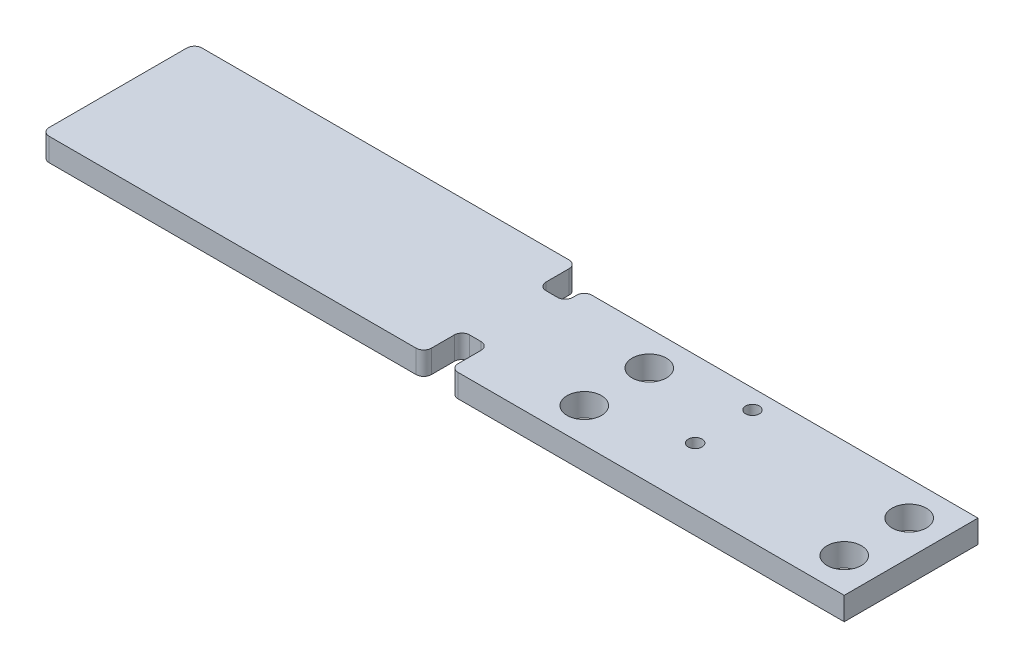
ISO-10303-21;
HEADER;
FILE_DESCRIPTION(('STEP AP214'),'2;1');
FILE_NAME('part.step','',(''),(''),'','','');
FILE_SCHEMA(('AUTOMOTIVE_DESIGN { 1 0 10303 214 1 1 1 1 }'));
ENDSEC;
DATA;
#1=APPLICATION_CONTEXT('core data for automotive mechanical design processes');
#2=APPLICATION_PROTOCOL_DEFINITION('international standard','automotive_design',2000,#1);
#3=PRODUCT_CONTEXT('',#1,'mechanical');
#4=PRODUCT('Part','Part','',(#3));
#5=PRODUCT_RELATED_PRODUCT_CATEGORY('part','',(#4));
#6=PRODUCT_DEFINITION_FORMATION('','',#4);
#7=PRODUCT_DEFINITION_CONTEXT('part definition',#1,'design');
#8=PRODUCT_DEFINITION('design','',#6,#7);
#9=PRODUCT_DEFINITION_SHAPE('','',#8);
#10=(LENGTH_UNIT() NAMED_UNIT(*) SI_UNIT(.MILLI.,.METRE.));
#11=(NAMED_UNIT(*) PLANE_ANGLE_UNIT() SI_UNIT($,.RADIAN.));
#12=(NAMED_UNIT(*) SI_UNIT($,.STERADIAN.) SOLID_ANGLE_UNIT());
#13=UNCERTAINTY_MEASURE_WITH_UNIT(LENGTH_MEASURE(1.E-05),#10,'distance_accuracy_value','');
#14=(GEOMETRIC_REPRESENTATION_CONTEXT(3) GLOBAL_UNCERTAINTY_ASSIGNED_CONTEXT((#13)) GLOBAL_UNIT_ASSIGNED_CONTEXT((#10,
#11,#12)) REPRESENTATION_CONTEXT('',''));
#15=CARTESIAN_POINT('',(0.,0.,0.));
#16=DIRECTION('',(0.,0.,1.));
#17=DIRECTION('',(1.,0.,0.));
#18=AXIS2_PLACEMENT_3D('',#15,#16,#17);
#19=CARTESIAN_POINT('',(0.,6.,-22.1596649405381));
#20=DIRECTION('',(0.,0.,-1.));
#21=DIRECTION('',(-1.,0.,0.));
#22=AXIS2_PLACEMENT_3D('',#19,#20,#21);
#23=PLANE('',#22);
#24=DIRECTION('',(1.,0.,0.));
#25=VECTOR('',#24,1.);
#26=CARTESIAN_POINT('',(0.,0.,-22.1596649405381));
#27=LINE('',#26,#25);
#28=CARTESIAN_POINT('',(28.4494296482818,0.,-22.1596649405381));
#29=VERTEX_POINT('',#28);
#30=CARTESIAN_POINT('',(31.4610570202952,0.,-22.1596649405381));
#31=VERTEX_POINT('',#30);
#32=EDGE_CURVE('E256',#29,#31,#27,.T.);
#33=ORIENTED_EDGE('',*,*,#32,.T.);
#34=DIRECTION('',(0.,-1.,0.));
#35=VECTOR('',#34,1.);
#36=CARTESIAN_POINT('',(31.4610570202952,6.,-22.1596649405381));
#37=LINE('',#36,#35);
#38=CARTESIAN_POINT('',(31.4610570202952,6.,-22.1596649405381));
#39=VERTEX_POINT('',#38);
#40=EDGE_CURVE('E11',#39,#31,#37,.T.);
#41=ORIENTED_EDGE('',*,*,#40,.F.);
#42=DIRECTION('',(1.,0.,0.));
#43=VECTOR('',#42,1.);
#44=CARTESIAN_POINT('',(0.,6.,-22.1596649405381));
#45=LINE('',#44,#43);
#46=CARTESIAN_POINT('',(28.4494296482818,6.,-22.1596649405381));
#47=VERTEX_POINT('',#46);
#48=EDGE_CURVE('E889',#47,#39,#45,.T.);
#49=ORIENTED_EDGE('',*,*,#48,.F.);
#50=DIRECTION('',(0.,-1.,0.));
#51=VECTOR('',#50,1.);
#52=CARTESIAN_POINT('',(28.4494296482818,6.,-22.1596649405381));
#53=LINE('',#52,#51);
#54=EDGE_CURVE('E63',#47,#29,#53,.T.);
#55=ORIENTED_EDGE('',*,*,#54,.T.);
#56=EDGE_LOOP('',(#33,#41,#49,#55));
#57=FACE_BOUND('',#56,.T.);
#58=ADVANCED_FACE('F45',(#57),#23,.F.);
#59=CARTESIAN_POINT('',(31.4610570202952,6.,-20.1596649405381));
#60=DIRECTION('',(0.,-1.,0.));
#61=DIRECTION('',(0.,0.,-1.));
#62=AXIS2_PLACEMENT_3D('',#59,#60,#61);
#63=CYLINDRICAL_SURFACE('',#62,2.);
#64=CARTESIAN_POINT('',(31.4610570202952,0.,-20.1596649405381));
#65=DIRECTION('',(0.,1.,0.));
#66=DIRECTION('',(0.,0.,1.));
#67=AXIS2_PLACEMENT_3D('',#64,#65,#66);
#68=CIRCLE('',#67,2.);
#69=CARTESIAN_POINT('',(33.4610570202952,0.,-20.1596649405381));
#70=VERTEX_POINT('',#69);
#71=EDGE_CURVE('E259',#31,#70,#68,.F.);
#72=ORIENTED_EDGE('',*,*,#71,.T.);
#73=DIRECTION('',(0.,-1.,0.));
#74=VECTOR('',#73,1.);
#75=CARTESIAN_POINT('',(33.4610570202952,6.,-20.1596649405381));
#76=LINE('',#75,#74);
#77=CARTESIAN_POINT('',(33.4610570202952,6.,-20.1596649405381));
#78=VERTEX_POINT('',#77);
#79=EDGE_CURVE('E55',#78,#70,#76,.T.);
#80=ORIENTED_EDGE('',*,*,#79,.F.);
#81=CARTESIAN_POINT('',(31.4610570202952,6.,-20.1596649405381));
#82=DIRECTION('',(0.,1.,0.));
#83=DIRECTION('',(0.,0.,1.));
#84=AXIS2_PLACEMENT_3D('',#81,#82,#83);
#85=CIRCLE('',#84,2.);
#86=EDGE_CURVE('E143',#39,#78,#85,.F.);
#87=ORIENTED_EDGE('',*,*,#86,.F.);
#88=ORIENTED_EDGE('',*,*,#40,.T.);
#89=EDGE_LOOP('',(#72,#80,#87,#88));
#90=FACE_BOUND('',#89,.T.);
#91=ADVANCED_FACE('F491',(#90),#63,.F.);
#92=CARTESIAN_POINT('',(33.4610570202952,6.,0.));
#93=DIRECTION('',(1.,0.,0.));
#94=DIRECTION('',(0.,0.,-1.));
#95=AXIS2_PLACEMENT_3D('',#92,#93,#94);
#96=PLANE('',#95);
#97=DIRECTION('',(0.,0.,1.));
#98=VECTOR('',#97,1.);
#99=CARTESIAN_POINT('',(33.4610570202952,0.,0.));
#100=LINE('',#99,#98);
#101=CARTESIAN_POINT('',(33.4610570202952,0.,-14.1596649405381));
#102=VERTEX_POINT('',#101);
#103=EDGE_CURVE('E262',#70,#102,#100,.T.);
#104=ORIENTED_EDGE('',*,*,#103,.T.);
#105=DIRECTION('',(0.,-1.,0.));
#106=VECTOR('',#105,1.);
#107=CARTESIAN_POINT('',(33.4610570202952,6.,-14.1596649405381));
#108=LINE('',#107,#106);
#109=CARTESIAN_POINT('',(33.4610570202952,6.,-14.1596649405381));
#110=VERTEX_POINT('',#109);
#111=EDGE_CURVE('E389',#110,#102,#108,.T.);
#112=ORIENTED_EDGE('',*,*,#111,.F.);
#113=DIRECTION('',(0.,0.,1.));
#114=VECTOR('',#113,1.);
#115=CARTESIAN_POINT('',(33.4610570202952,6.,0.));
#116=LINE('',#115,#114);
#117=EDGE_CURVE('E399',#78,#110,#116,.T.);
#118=ORIENTED_EDGE('',*,*,#117,.F.);
#119=ORIENTED_EDGE('',*,*,#79,.T.);
#120=EDGE_LOOP('',(#104,#112,#118,#119));
#121=FACE_BOUND('',#120,.T.);
#122=ADVANCED_FACE('F397',(#121),#96,.F.);
#123=CARTESIAN_POINT('',(35.4610570202952,6.,-14.1596649405381));
#124=DIRECTION('',(0.,-1.,0.));
#125=DIRECTION('',(0.,0.,-1.));
#126=AXIS2_PLACEMENT_3D('',#123,#124,#125);
#127=CYLINDRICAL_SURFACE('',#126,2.);
#128=CARTESIAN_POINT('',(35.4610570202952,0.,-14.1596649405381));
#129=DIRECTION('',(0.,1.,0.));
#130=DIRECTION('',(0.,0.,1.));
#131=AXIS2_PLACEMENT_3D('',#128,#129,#130);
#132=CIRCLE('',#131,2.);
#133=CARTESIAN_POINT('',(35.4610570202952,0.,-12.1596649405381));
#134=VERTEX_POINT('',#133);
#135=EDGE_CURVE('E265',#102,#134,#132,.T.);
#136=ORIENTED_EDGE('',*,*,#135,.T.);
#137=DIRECTION('',(0.,-1.,0.));
#138=VECTOR('',#137,1.);
#139=CARTESIAN_POINT('',(35.4610570202952,6.,-12.1596649405381));
#140=LINE('',#139,#138);
#141=CARTESIAN_POINT('',(35.4610570202952,6.,-12.1596649405381));
#142=VERTEX_POINT('',#141);
#143=EDGE_CURVE('E385',#142,#134,#140,.T.);
#144=ORIENTED_EDGE('',*,*,#143,.F.);
#145=CARTESIAN_POINT('',(35.4610570202952,6.,-14.1596649405381));
#146=DIRECTION('',(0.,1.,0.));
#147=DIRECTION('',(0.,0.,1.));
#148=AXIS2_PLACEMENT_3D('',#145,#146,#147);
#149=CIRCLE('',#148,2.);
#150=EDGE_CURVE('E417',#110,#142,#149,.T.);
#151=ORIENTED_EDGE('',*,*,#150,.F.);
#152=ORIENTED_EDGE('',*,*,#111,.T.);
#153=EDGE_LOOP('',(#136,#144,#151,#152));
#154=FACE_BOUND('',#153,.T.);
#155=ADVANCED_FACE('F407',(#154),#127,.T.);
#156=CARTESIAN_POINT('',(0.,6.,-12.1596649405381));
#157=DIRECTION('',(0.,0.,-1.));
#158=DIRECTION('',(-1.,0.,0.));
#159=AXIS2_PLACEMENT_3D('',#156,#157,#158);
#160=PLANE('',#159);
#161=DIRECTION('',(1.,0.,0.));
#162=VECTOR('',#161,1.);
#163=CARTESIAN_POINT('',(0.,0.,-12.1596649405381));
#164=LINE('',#163,#162);
#165=CARTESIAN_POINT('',(136.461057020295,0.,-12.1596649405381));
#166=VERTEX_POINT('',#165);
#167=EDGE_CURVE('E268',#134,#166,#164,.T.);
#168=ORIENTED_EDGE('',*,*,#167,.T.);
#169=DIRECTION('',(0.,-1.,0.));
#170=VECTOR('',#169,1.);
#171=CARTESIAN_POINT('',(136.461057020295,6.,-12.1596649405381));
#172=LINE('',#171,#170);
#173=CARTESIAN_POINT('',(136.461057020295,6.,-12.1596649405381));
#174=VERTEX_POINT('',#173);
#175=EDGE_CURVE('E381',#174,#166,#172,.T.);
#176=ORIENTED_EDGE('',*,*,#175,.F.);
#177=DIRECTION('',(1.,0.,0.));
#178=VECTOR('',#177,1.);
#179=CARTESIAN_POINT('',(0.,6.,-12.1596649405381));
#180=LINE('',#179,#178);
#181=EDGE_CURVE('E413',#142,#174,#180,.T.);
#182=ORIENTED_EDGE('',*,*,#181,.F.);
#183=ORIENTED_EDGE('',*,*,#143,.T.);
#184=EDGE_LOOP('',(#168,#176,#182,#183));
#185=FACE_BOUND('',#184,.T.);
#186=ADVANCED_FACE('F411',(#185),#160,.F.);
#187=CARTESIAN_POINT('',(136.461057020295,6.,0.));
#188=DIRECTION('',(-1.,0.,0.));
#189=DIRECTION('',(0.,0.,1.));
#190=AXIS2_PLACEMENT_3D('',#187,#188,#189);
#191=PLANE('',#190);
#192=DIRECTION('',(0.,0.,-1.));
#193=VECTOR('',#192,1.);
#194=CARTESIAN_POINT('',(136.461057020295,0.,0.));
#195=LINE('',#194,#193);
#196=CARTESIAN_POINT('',(136.461057020295,0.,-47.1596649405381));
#197=VERTEX_POINT('',#196);
#198=EDGE_CURVE('E271',#166,#197,#195,.T.);
#199=ORIENTED_EDGE('',*,*,#198,.T.);
#200=DIRECTION('',(0.,-1.,0.));
#201=VECTOR('',#200,1.);
#202=CARTESIAN_POINT('',(136.461057020295,6.,-47.1596649405381));
#203=LINE('',#202,#201);
#204=CARTESIAN_POINT('',(136.461057020295,6.,-47.1596649405381));
#205=VERTEX_POINT('',#204);
#206=EDGE_CURVE('E377',#205,#197,#203,.T.);
#207=ORIENTED_EDGE('',*,*,#206,.F.);
#208=DIRECTION('',(0.,0.,-1.));
#209=VECTOR('',#208,1.);
#210=CARTESIAN_POINT('',(136.461057020295,6.,0.));
#211=LINE('',#210,#209);
#212=EDGE_CURVE('E416',#174,#205,#211,.T.);
#213=ORIENTED_EDGE('',*,*,#212,.F.);
#214=ORIENTED_EDGE('',*,*,#175,.T.);
#215=EDGE_LOOP('',(#199,#207,#213,#214));
#216=FACE_BOUND('',#215,.T.);
#217=ADVANCED_FACE('F747',(#216),#191,.F.);
#218=CARTESIAN_POINT('',(0.,6.,-47.1596649405381));
#219=DIRECTION('',(0.,0.,1.));
#220=DIRECTION('',(1.,0.,0.));
#221=AXIS2_PLACEMENT_3D('',#218,#219,#220);
#222=PLANE('',#221);
#223=DIRECTION('',(-1.,0.,0.));
#224=VECTOR('',#223,1.);
#225=CARTESIAN_POINT('',(0.,0.,-47.1596649405381));
#226=LINE('',#225,#224);
#227=CARTESIAN_POINT('',(35.4610570202952,0.,-47.1596649405381));
#228=VERTEX_POINT('',#227);
#229=EDGE_CURVE('E274',#197,#228,#226,.T.);
#230=ORIENTED_EDGE('',*,*,#229,.T.);
#231=DIRECTION('',(0.,-1.,0.));
#232=VECTOR('',#231,1.);
#233=CARTESIAN_POINT('',(35.4610570202952,6.,-47.1596649405381));
#234=LINE('',#233,#232);
#235=CARTESIAN_POINT('',(35.4610570202952,6.,-47.1596649405381));
#236=VERTEX_POINT('',#235);
#237=EDGE_CURVE('E373',#236,#228,#234,.T.);
#238=ORIENTED_EDGE('',*,*,#237,.F.);
#239=DIRECTION('',(-1.,0.,0.));
#240=VECTOR('',#239,1.);
#241=CARTESIAN_POINT('',(0.,6.,-47.1596649405381));
#242=LINE('',#241,#240);
#243=EDGE_CURVE('E421',#205,#236,#242,.T.);
#244=ORIENTED_EDGE('',*,*,#243,.F.);
#245=ORIENTED_EDGE('',*,*,#206,.T.);
#246=EDGE_LOOP('',(#230,#238,#244,#245));
#247=FACE_BOUND('',#246,.T.);
#248=ADVANCED_FACE('F736',(#247),#222,.F.);
#249=CARTESIAN_POINT('',(35.4610570202952,6.,-45.1596649405381));
#250=DIRECTION('',(0.,-1.,0.));
#251=DIRECTION('',(0.,0.,-1.));
#252=AXIS2_PLACEMENT_3D('',#249,#250,#251);
#253=CYLINDRICAL_SURFACE('',#252,2.);
#254=CARTESIAN_POINT('',(35.4610570202952,0.,-45.1596649405381));
#255=DIRECTION('',(0.,1.,0.));
#256=DIRECTION('',(0.,0.,1.));
#257=AXIS2_PLACEMENT_3D('',#254,#255,#256);
#258=CIRCLE('',#257,2.);
#259=CARTESIAN_POINT('',(33.4610570202952,0.,-45.1596649405381));
#260=VERTEX_POINT('',#259);
#261=EDGE_CURVE('E277',#228,#260,#258,.T.);
#262=ORIENTED_EDGE('',*,*,#261,.T.);
#263=DIRECTION('',(0.,-1.,0.));
#264=VECTOR('',#263,1.);
#265=CARTESIAN_POINT('',(33.4610570202952,6.,-45.1596649405381));
#266=LINE('',#265,#264);
#267=CARTESIAN_POINT('',(33.4610570202952,6.,-45.1596649405381));
#268=VERTEX_POINT('',#267);
#269=EDGE_CURVE('E370',#268,#260,#266,.T.);
#270=ORIENTED_EDGE('',*,*,#269,.F.);
#271=CARTESIAN_POINT('',(35.4610570202952,6.,-45.1596649405381));
#272=DIRECTION('',(0.,1.,0.));
#273=DIRECTION('',(0.,0.,1.));
#274=AXIS2_PLACEMENT_3D('',#271,#272,#273);
#275=CIRCLE('',#274,2.);
#276=EDGE_CURVE('E428',#236,#268,#275,.T.);
#277=ORIENTED_EDGE('',*,*,#276,.F.);
#278=ORIENTED_EDGE('',*,*,#237,.T.);
#279=EDGE_LOOP('',(#262,#270,#277,#278));
#280=FACE_BOUND('',#279,.T.);
#281=ADVANCED_FACE('F725',(#280),#253,.T.);
#282=CARTESIAN_POINT('',(33.4610570202952,6.,0.));
#283=DIRECTION('',(-1.,0.,0.));
#284=DIRECTION('',(0.,0.,1.));
#285=AXIS2_PLACEMENT_3D('',#282,#283,#284);
#286=PLANE('',#285);
#287=DIRECTION('',(0.,0.,-1.));
#288=VECTOR('',#287,1.);
#289=CARTESIAN_POINT('',(33.4610570202952,0.,0.));
#290=LINE('',#289,#288);
#291=CARTESIAN_POINT('',(33.4610570202952,0.,-44.1596649405381));
#292=VERTEX_POINT('',#291);
#293=EDGE_CURVE('E281',#292,#260,#290,.T.);
#294=ORIENTED_EDGE('',*,*,#293,.F.);
#295=DIRECTION('',(0.,-1.,0.));
#296=VECTOR('',#295,1.);
#297=CARTESIAN_POINT('',(33.4610570202952,6.,-44.1596649405381));
#298=LINE('',#297,#296);
#299=CARTESIAN_POINT('',(33.4610570202952,6.,-44.1596649405381));
#300=VERTEX_POINT('',#299);
#301=EDGE_CURVE('E367',#300,#292,#298,.T.);
#302=ORIENTED_EDGE('',*,*,#301,.F.);
#303=DIRECTION('',(0.,0.,-1.));
#304=VECTOR('',#303,1.);
#305=CARTESIAN_POINT('',(33.4610570202952,6.,0.));
#306=LINE('',#305,#304);
#307=EDGE_CURVE('E431',#300,#268,#306,.T.);
#308=ORIENTED_EDGE('',*,*,#307,.T.);
#309=ORIENTED_EDGE('',*,*,#269,.T.);
#310=EDGE_LOOP('',(#294,#302,#308,#309));
#311=FACE_BOUND('',#310,.T.);
#312=ADVANCED_FACE('F714',(#311),#286,.T.);
#313=CARTESIAN_POINT('',(31.4610570202952,6.,-44.1596649405381));
#314=DIRECTION('',(0.,-1.,0.));
#315=DIRECTION('',(0.,0.,-1.));
#316=AXIS2_PLACEMENT_3D('',#313,#314,#315);
#317=CYLINDRICAL_SURFACE('',#316,2.);
#318=CARTESIAN_POINT('',(31.4610570202952,0.,-44.1596649405381));
#319=DIRECTION('',(0.,1.,0.));
#320=DIRECTION('',(0.,0.,1.));
#321=AXIS2_PLACEMENT_3D('',#318,#319,#320);
#322=CIRCLE('',#321,2.);
#323=CARTESIAN_POINT('',(31.4610570202952,0.,-42.1596649405381));
#324=VERTEX_POINT('',#323);
#325=EDGE_CURVE('E285',#324,#292,#322,.T.);
#326=ORIENTED_EDGE('',*,*,#325,.F.);
#327=DIRECTION('',(0.,-1.,0.));
#328=VECTOR('',#327,1.);
#329=CARTESIAN_POINT('',(31.4610570202952,6.,-42.1596649405381));
#330=LINE('',#329,#328);
#331=CARTESIAN_POINT('',(31.4610570202952,6.,-42.1596649405381));
#332=VERTEX_POINT('',#331);
#333=EDGE_CURVE('E364',#332,#324,#330,.T.);
#334=ORIENTED_EDGE('',*,*,#333,.F.);
#335=CARTESIAN_POINT('',(31.4610570202952,6.,-44.1596649405381));
#336=DIRECTION('',(0.,1.,0.));
#337=DIRECTION('',(0.,0.,1.));
#338=AXIS2_PLACEMENT_3D('',#335,#336,#337);
#339=CIRCLE('',#338,2.);
#340=EDGE_CURVE('E435',#332,#300,#339,.T.);
#341=ORIENTED_EDGE('',*,*,#340,.T.);
#342=ORIENTED_EDGE('',*,*,#301,.T.);
#343=EDGE_LOOP('',(#326,#334,#341,#342));
#344=FACE_BOUND('',#343,.T.);
#345=ADVANCED_FACE('F703',(#344),#317,.F.);
#346=CARTESIAN_POINT('',(0.,6.,-42.1596649405381));
#347=DIRECTION('',(0.,0.,-1.));
#348=DIRECTION('',(-1.,0.,0.));
#349=AXIS2_PLACEMENT_3D('',#346,#347,#348);
#350=PLANE('',#349);
#351=DIRECTION('',(1.,0.,0.));
#352=VECTOR('',#351,1.);
#353=CARTESIAN_POINT('',(0.,0.,-42.1596649405381));
#354=LINE('',#353,#352);
#355=CARTESIAN_POINT('',(28.4610570202953,0.,-42.1596649405381));
#356=VERTEX_POINT('',#355);
#357=EDGE_CURVE('E289',#356,#324,#354,.T.);
#358=ORIENTED_EDGE('',*,*,#357,.F.);
#359=DIRECTION('',(0.,-1.,0.));
#360=VECTOR('',#359,1.);
#361=CARTESIAN_POINT('',(28.4610570202953,6.,-42.1596649405381));
#362=LINE('',#361,#360);
#363=CARTESIAN_POINT('',(28.4610570202953,6.,-42.1596649405381));
#364=VERTEX_POINT('',#363);
#365=EDGE_CURVE('E361',#364,#356,#362,.T.);
#366=ORIENTED_EDGE('',*,*,#365,.F.);
#367=DIRECTION('',(1.,0.,0.));
#368=VECTOR('',#367,1.);
#369=CARTESIAN_POINT('',(0.,6.,-42.1596649405381));
#370=LINE('',#369,#368);
#371=EDGE_CURVE('E439',#364,#332,#370,.T.);
#372=ORIENTED_EDGE('',*,*,#371,.T.);
#373=ORIENTED_EDGE('',*,*,#333,.T.);
#374=EDGE_LOOP('',(#358,#366,#372,#373));
#375=FACE_BOUND('',#374,.T.);
#376=ADVANCED_FACE('F692',(#375),#350,.T.);
#377=CARTESIAN_POINT('',(28.4610570202952,6.,-44.1596649405381));
#378=DIRECTION('',(0.,-1.,0.));
#379=DIRECTION('',(0.,0.,-1.));
#380=AXIS2_PLACEMENT_3D('',#377,#378,#379);
#381=CYLINDRICAL_SURFACE('',#380,2.);
#382=CARTESIAN_POINT('',(28.4610570202952,0.,-44.1596649405381));
#383=DIRECTION('',(0.,1.,0.));
#384=DIRECTION('',(0.,0.,1.));
#385=AXIS2_PLACEMENT_3D('',#382,#383,#384);
#386=CIRCLE('',#385,2.);
#387=CARTESIAN_POINT('',(26.4610570202952,0.,-44.1596649405381));
#388=VERTEX_POINT('',#387);
#389=EDGE_CURVE('E293',#388,#356,#386,.T.);
#390=ORIENTED_EDGE('',*,*,#389,.F.);
#391=DIRECTION('',(0.,-1.,0.));
#392=VECTOR('',#391,1.);
#393=CARTESIAN_POINT('',(26.4610570202952,6.,-44.1596649405381));
#394=LINE('',#393,#392);
#395=CARTESIAN_POINT('',(26.4610570202952,6.,-44.1596649405381));
#396=VERTEX_POINT('',#395);
#397=EDGE_CURVE('E358',#396,#388,#394,.T.);
#398=ORIENTED_EDGE('',*,*,#397,.F.);
#399=CARTESIAN_POINT('',(28.4610570202952,6.,-44.1596649405381));
#400=DIRECTION('',(0.,1.,0.));
#401=DIRECTION('',(0.,0.,1.));
#402=AXIS2_PLACEMENT_3D('',#399,#400,#401);
#403=CIRCLE('',#402,2.);
#404=EDGE_CURVE('E443',#396,#364,#403,.T.);
#405=ORIENTED_EDGE('',*,*,#404,.T.);
#406=ORIENTED_EDGE('',*,*,#365,.T.);
#407=EDGE_LOOP('',(#390,#398,#405,#406));
#408=FACE_BOUND('',#407,.T.);
#409=ADVANCED_FACE('F681',(#408),#381,.F.);
#410=CARTESIAN_POINT('',(26.4610570202952,6.,0.));
#411=DIRECTION('',(1.,0.,0.));
#412=DIRECTION('',(0.,0.,-1.));
#413=AXIS2_PLACEMENT_3D('',#410,#411,#412);
#414=PLANE('',#413);
#415=DIRECTION('',(0.,0.,1.));
#416=VECTOR('',#415,1.);
#417=CARTESIAN_POINT('',(26.4610570202952,0.,0.));
#418=LINE('',#417,#416);
#419=CARTESIAN_POINT('',(26.4610570202952,0.,-50.1596649405381));
#420=VERTEX_POINT('',#419);
#421=EDGE_CURVE('E297',#420,#388,#418,.T.);
#422=ORIENTED_EDGE('',*,*,#421,.F.);
#423=DIRECTION('',(0.,-1.,0.));
#424=VECTOR('',#423,1.);
#425=CARTESIAN_POINT('',(26.4610570202952,6.,-50.1596649405381));
#426=LINE('',#425,#424);
#427=CARTESIAN_POINT('',(26.4610570202952,6.,-50.1596649405381));
#428=VERTEX_POINT('',#427);
#429=EDGE_CURVE('E355',#428,#420,#426,.T.);
#430=ORIENTED_EDGE('',*,*,#429,.F.);
#431=DIRECTION('',(0.,0.,1.));
#432=VECTOR('',#431,1.);
#433=CARTESIAN_POINT('',(26.4610570202952,6.,0.));
#434=LINE('',#433,#432);
#435=EDGE_CURVE('E447',#428,#396,#434,.T.);
#436=ORIENTED_EDGE('',*,*,#435,.T.);
#437=ORIENTED_EDGE('',*,*,#397,.T.);
#438=EDGE_LOOP('',(#422,#430,#436,#437));
#439=FACE_BOUND('',#438,.T.);
#440=ADVANCED_FACE('F670',(#439),#414,.T.);
#441=CARTESIAN_POINT('',(24.4610570202952,6.,-50.1596649405381));
#442=DIRECTION('',(0.,-1.,0.));
#443=DIRECTION('',(0.,0.,-1.));
#444=AXIS2_PLACEMENT_3D('',#441,#442,#443);
#445=CYLINDRICAL_SURFACE('',#444,2.);
#446=CARTESIAN_POINT('',(24.4610570202952,0.,-50.1596649405381));
#447=DIRECTION('',(0.,1.,0.));
#448=DIRECTION('',(0.,0.,1.));
#449=AXIS2_PLACEMENT_3D('',#446,#447,#448);
#450=CIRCLE('',#449,2.);
#451=CARTESIAN_POINT('',(24.4610570202952,0.,-52.1596649405381));
#452=VERTEX_POINT('',#451);
#453=EDGE_CURVE('E301',#420,#452,#450,.T.);
#454=ORIENTED_EDGE('',*,*,#453,.T.);
#455=DIRECTION('',(0.,-1.,0.));
#456=VECTOR('',#455,1.);
#457=CARTESIAN_POINT('',(24.4610570202952,6.,-52.1596649405381));
#458=LINE('',#457,#456);
#459=CARTESIAN_POINT('',(24.4610570202952,6.,-52.1596649405381));
#460=VERTEX_POINT('',#459);
#461=EDGE_CURVE('E352',#460,#452,#458,.T.);
#462=ORIENTED_EDGE('',*,*,#461,.F.);
#463=CARTESIAN_POINT('',(24.4610570202952,6.,-50.1596649405381));
#464=DIRECTION('',(0.,1.,0.));
#465=DIRECTION('',(0.,0.,1.));
#466=AXIS2_PLACEMENT_3D('',#463,#464,#465);
#467=CIRCLE('',#466,2.);
#468=EDGE_CURVE('E451',#428,#460,#467,.T.);
#469=ORIENTED_EDGE('',*,*,#468,.F.);
#470=ORIENTED_EDGE('',*,*,#429,.T.);
#471=EDGE_LOOP('',(#454,#462,#469,#470));
#472=FACE_BOUND('',#471,.T.);
#473=ADVANCED_FACE('F659',(#472),#445,.T.);
#474=CARTESIAN_POINT('',(0.,6.,-52.1596649405381));
#475=DIRECTION('',(0.,0.,-1.));
#476=DIRECTION('',(-1.,0.,0.));
#477=AXIS2_PLACEMENT_3D('',#474,#475,#476);
#478=PLANE('',#477);
#479=DIRECTION('',(1.,0.,0.));
#480=VECTOR('',#479,1.);
#481=CARTESIAN_POINT('',(0.,0.,-52.1596649405381));
#482=LINE('',#481,#480);
#483=CARTESIAN_POINT('',(-71.5389429797048,0.,-52.159664940538));
#484=VERTEX_POINT('',#483);
#485=EDGE_CURVE('E305',#484,#452,#482,.T.);
#486=ORIENTED_EDGE('',*,*,#485,.F.);
#487=DIRECTION('',(0.,-1.,0.));
#488=VECTOR('',#487,1.);
#489=CARTESIAN_POINT('',(-71.5389429797048,6.,-52.159664940538));
#490=LINE('',#489,#488);
#491=CARTESIAN_POINT('',(-71.5389429797048,6.,-52.159664940538));
#492=VERTEX_POINT('',#491);
#493=EDGE_CURVE('E349',#492,#484,#490,.T.);
#494=ORIENTED_EDGE('',*,*,#493,.F.);
#495=DIRECTION('',(1.,0.,0.));
#496=VECTOR('',#495,1.);
#497=CARTESIAN_POINT('',(0.,6.,-52.1596649405381));
#498=LINE('',#497,#496);
#499=EDGE_CURVE('E454',#492,#460,#498,.T.);
#500=ORIENTED_EDGE('',*,*,#499,.T.);
#501=ORIENTED_EDGE('',*,*,#461,.T.);
#502=EDGE_LOOP('',(#486,#494,#500,#501));
#503=FACE_BOUND('',#502,.T.);
#504=ADVANCED_FACE('F648',(#503),#478,.T.);
#505=CARTESIAN_POINT('',(-71.5389429797048,6.,-50.1596649405381));
#506=DIRECTION('',(0.,-1.,0.));
#507=DIRECTION('',(0.,0.,-1.));
#508=AXIS2_PLACEMENT_3D('',#505,#506,#507);
#509=CYLINDRICAL_SURFACE('',#508,1.99999999999999);
#510=CARTESIAN_POINT('',(-71.5389429797048,0.,-50.1596649405381));
#511=DIRECTION('',(0.,1.,0.));
#512=DIRECTION('',(0.,0.,1.));
#513=AXIS2_PLACEMENT_3D('',#510,#511,#512);
#514=CIRCLE('',#513,1.99999999999999);
#515=CARTESIAN_POINT('',(-73.5389429797048,0.,-50.1596649405381));
#516=VERTEX_POINT('',#515);
#517=EDGE_CURVE('E309',#484,#516,#514,.T.);
#518=ORIENTED_EDGE('',*,*,#517,.T.);
#519=DIRECTION('',(0.,-1.,0.));
#520=VECTOR('',#519,1.);
#521=CARTESIAN_POINT('',(-73.5389429797048,6.,-50.1596649405381));
#522=LINE('',#521,#520);
#523=CARTESIAN_POINT('',(-73.5389429797048,6.,-50.1596649405381));
#524=VERTEX_POINT('',#523);
#525=EDGE_CURVE('E345',#524,#516,#522,.T.);
#526=ORIENTED_EDGE('',*,*,#525,.F.);
#527=CARTESIAN_POINT('',(-71.5389429797048,6.,-50.1596649405381));
#528=DIRECTION('',(0.,1.,0.));
#529=DIRECTION('',(0.,0.,1.));
#530=AXIS2_PLACEMENT_3D('',#527,#528,#529);
#531=CIRCLE('',#530,1.99999999999999);
#532=EDGE_CURVE('E458',#492,#524,#531,.T.);
#533=ORIENTED_EDGE('',*,*,#532,.F.);
#534=ORIENTED_EDGE('',*,*,#493,.T.);
#535=EDGE_LOOP('',(#518,#526,#533,#534));
#536=FACE_BOUND('',#535,.T.);
#537=ADVANCED_FACE('F637',(#536),#509,.T.);
#538=CARTESIAN_POINT('',(-73.5389429797048,6.,0.));
#539=DIRECTION('',(1.,0.,0.));
#540=DIRECTION('',(0.,0.,-1.));
#541=AXIS2_PLACEMENT_3D('',#538,#539,#540);
#542=PLANE('',#541);
#543=DIRECTION('',(0.,0.,1.));
#544=VECTOR('',#543,1.);
#545=CARTESIAN_POINT('',(-73.5389429797048,0.,0.));
#546=LINE('',#545,#544);
#547=CARTESIAN_POINT('',(-73.5389429797048,0.,-14.1596649405381));
#548=VERTEX_POINT('',#547);
#549=EDGE_CURVE('E312',#516,#548,#546,.T.);
#550=ORIENTED_EDGE('',*,*,#549,.T.);
#551=DIRECTION('',(0.,-1.,0.));
#552=VECTOR('',#551,1.);
#553=CARTESIAN_POINT('',(-73.5389429797048,6.,-14.1596649405381));
#554=LINE('',#553,#552);
#555=CARTESIAN_POINT('',(-73.5389429797048,6.,-14.1596649405381));
#556=VERTEX_POINT('',#555);
#557=EDGE_CURVE('E341',#556,#548,#554,.T.);
#558=ORIENTED_EDGE('',*,*,#557,.F.);
#559=DIRECTION('',(0.,0.,1.));
#560=VECTOR('',#559,1.);
#561=CARTESIAN_POINT('',(-73.5389429797048,6.,0.));
#562=LINE('',#561,#560);
#563=EDGE_CURVE('E461',#524,#556,#562,.T.);
#564=ORIENTED_EDGE('',*,*,#563,.F.);
#565=ORIENTED_EDGE('',*,*,#525,.T.);
#566=EDGE_LOOP('',(#550,#558,#564,#565));
#567=FACE_BOUND('',#566,.T.);
#568=ADVANCED_FACE('F627',(#567),#542,.F.);
#569=CARTESIAN_POINT('',(-71.5389429797048,6.,-14.1596649405381));
#570=DIRECTION('',(0.,-1.,0.));
#571=DIRECTION('',(0.,0.,-1.));
#572=AXIS2_PLACEMENT_3D('',#569,#570,#571);
#573=CYLINDRICAL_SURFACE('',#572,2.);
#574=CARTESIAN_POINT('',(-71.5389429797048,0.,-14.1596649405381));
#575=DIRECTION('',(0.,1.,0.));
#576=DIRECTION('',(0.,0.,1.));
#577=AXIS2_PLACEMENT_3D('',#574,#575,#576);
#578=CIRCLE('',#577,2.);
#579=CARTESIAN_POINT('',(-71.5389429797048,0.,-12.1596649405381));
#580=VERTEX_POINT('',#579);
#581=EDGE_CURVE('E315',#548,#580,#578,.T.);
#582=ORIENTED_EDGE('',*,*,#581,.T.);
#583=DIRECTION('',(0.,-1.,0.));
#584=VECTOR('',#583,1.);
#585=CARTESIAN_POINT('',(-71.5389429797048,6.,-12.1596649405381));
#586=LINE('',#585,#584);
#587=CARTESIAN_POINT('',(-71.5389429797048,6.,-12.1596649405381));
#588=VERTEX_POINT('',#587);
#589=EDGE_CURVE('E337',#588,#580,#586,.T.);
#590=ORIENTED_EDGE('',*,*,#589,.F.);
#591=CARTESIAN_POINT('',(-71.5389429797048,6.,-14.1596649405381));
#592=DIRECTION('',(0.,1.,0.));
#593=DIRECTION('',(0.,0.,1.));
#594=AXIS2_PLACEMENT_3D('',#591,#592,#593);
#595=CIRCLE('',#594,2.);
#596=EDGE_CURVE('E464',#556,#588,#595,.T.);
#597=ORIENTED_EDGE('',*,*,#596,.F.);
#598=ORIENTED_EDGE('',*,*,#557,.T.);
#599=EDGE_LOOP('',(#582,#590,#597,#598));
#600=FACE_BOUND('',#599,.T.);
#601=ADVANCED_FACE('F472',(#600),#573,.T.);
#602=CARTESIAN_POINT('',(0.,6.,-12.1596649405381));
#603=DIRECTION('',(0.,0.,-1.));
#604=DIRECTION('',(-1.,0.,0.));
#605=AXIS2_PLACEMENT_3D('',#602,#603,#604);
#606=PLANE('',#605);
#607=DIRECTION('',(1.,0.,0.));
#608=VECTOR('',#607,1.);
#609=CARTESIAN_POINT('',(0.,0.,-12.1596649405381));
#610=LINE('',#609,#608);
#611=CARTESIAN_POINT('',(24.4610570202952,0.,-12.1596649405381));
#612=VERTEX_POINT('',#611);
#613=EDGE_CURVE('E318',#580,#612,#610,.T.);
#614=ORIENTED_EDGE('',*,*,#613,.T.);
#615=DIRECTION('',(0.,-1.,0.));
#616=VECTOR('',#615,1.);
#617=CARTESIAN_POINT('',(24.4610570202952,6.,-12.1596649405381));
#618=LINE('',#617,#616);
#619=CARTESIAN_POINT('',(24.4610570202952,6.,-12.1596649405381));
#620=VERTEX_POINT('',#619);
#621=EDGE_CURVE('E222',#620,#612,#618,.T.);
#622=ORIENTED_EDGE('',*,*,#621,.F.);
#623=DIRECTION('',(1.,0.,0.));
#624=VECTOR('',#623,1.);
#625=CARTESIAN_POINT('',(0.,6.,-12.1596649405381));
#626=LINE('',#625,#624);
#627=EDGE_CURVE('E208',#588,#620,#626,.T.);
#628=ORIENTED_EDGE('',*,*,#627,.F.);
#629=ORIENTED_EDGE('',*,*,#589,.T.);
#630=EDGE_LOOP('',(#614,#622,#628,#629));
#631=FACE_BOUND('',#630,.T.);
#632=ADVANCED_FACE('F476',(#631),#606,.F.);
#633=CARTESIAN_POINT('',(24.4610570202952,6.,-14.1596649405381));
#634=DIRECTION('',(0.,-1.,0.));
#635=DIRECTION('',(0.,0.,-1.));
#636=AXIS2_PLACEMENT_3D('',#633,#634,#635);
#637=CYLINDRICAL_SURFACE('',#636,1.99999999999999);
#638=CARTESIAN_POINT('',(24.4610570202952,0.,-14.1596649405381));
#639=DIRECTION('',(0.,1.,0.));
#640=DIRECTION('',(0.,0.,1.));
#641=AXIS2_PLACEMENT_3D('',#638,#639,#640);
#642=CIRCLE('',#641,1.99999999999999);
#643=CARTESIAN_POINT('',(26.4610570202952,0.,-14.1596649405381));
#644=VERTEX_POINT('',#643);
#645=EDGE_CURVE('E218',#612,#644,#642,.T.);
#646=ORIENTED_EDGE('',*,*,#645,.T.);
#647=DIRECTION('',(0.,-1.,0.));
#648=VECTOR('',#647,1.);
#649=CARTESIAN_POINT('',(26.4610570202952,6.,-14.1596649405381));
#650=LINE('',#649,#648);
#651=CARTESIAN_POINT('',(26.4610570202952,6.,-14.1596649405381));
#652=VERTEX_POINT('',#651);
#653=EDGE_CURVE('E215',#652,#644,#650,.T.);
#654=ORIENTED_EDGE('',*,*,#653,.F.);
#655=CARTESIAN_POINT('',(24.4610570202952,6.,-14.1596649405381));
#656=DIRECTION('',(0.,1.,0.));
#657=DIRECTION('',(0.,0.,1.));
#658=AXIS2_PLACEMENT_3D('',#655,#656,#657);
#659=CIRCLE('',#658,1.99999999999999);
#660=EDGE_CURVE('E201',#620,#652,#659,.T.);
#661=ORIENTED_EDGE('',*,*,#660,.F.);
#662=ORIENTED_EDGE('',*,*,#621,.T.);
#663=EDGE_LOOP('',(#646,#654,#661,#662));
#664=FACE_BOUND('',#663,.T.);
#665=ADVANCED_FACE('F216',(#664),#637,.T.);
#666=CARTESIAN_POINT('',(26.4610570202952,6.,0.));
#667=DIRECTION('',(1.,0.,0.));
#668=DIRECTION('',(0.,0.,-1.));
#669=AXIS2_PLACEMENT_3D('',#666,#667,#668);
#670=PLANE('',#669);
#671=DIRECTION('',(0.,0.,1.));
#672=VECTOR('',#671,1.);
#673=CARTESIAN_POINT('',(26.4610570202952,0.,0.));
#674=LINE('',#673,#672);
#675=CARTESIAN_POINT('',(26.4610570202952,0.,-20.1712923125515));
#676=VERTEX_POINT('',#675);
#677=EDGE_CURVE('E323',#676,#644,#674,.T.);
#678=ORIENTED_EDGE('',*,*,#677,.F.);
#679=DIRECTION('',(0.,-1.,0.));
#680=VECTOR('',#679,1.);
#681=CARTESIAN_POINT('',(26.4610570202952,6.,-20.1712923125515));
#682=LINE('',#681,#680);
#683=CARTESIAN_POINT('',(26.4610570202952,6.,-20.1712923125515));
#684=VERTEX_POINT('',#683);
#685=EDGE_CURVE('E131',#684,#676,#682,.T.);
#686=ORIENTED_EDGE('',*,*,#685,.F.);
#687=DIRECTION('',(0.,0.,1.));
#688=VECTOR('',#687,1.);
#689=CARTESIAN_POINT('',(26.4610570202952,6.,0.));
#690=LINE('',#689,#688);
#691=EDGE_CURVE('E206',#684,#652,#690,.T.);
#692=ORIENTED_EDGE('',*,*,#691,.T.);
#693=ORIENTED_EDGE('',*,*,#653,.T.);
#694=EDGE_LOOP('',(#678,#686,#692,#693));
#695=FACE_BOUND('',#694,.T.);
#696=ADVANCED_FACE('F224',(#695),#670,.T.);
#697=CARTESIAN_POINT('',(82.4610570202952,6.,-42.1596649405381));
#698=DIRECTION('',(0.,-1.,0.));
#699=DIRECTION('',(0.,0.,-1.));
#700=AXIS2_PLACEMENT_3D('',#697,#698,#699);
#701=CYLINDRICAL_SURFACE('',#700,1.79999999999999);
#702=CARTESIAN_POINT('',(82.4610570202952,6.,-42.1596649405381));
#703=DIRECTION('',(0.,1.,0.));
#704=DIRECTION('',(0.,0.,1.));
#705=AXIS2_PLACEMENT_3D('',#702,#703,#704);
#706=CIRCLE('',#705,1.79999999999999);
#707=CARTESIAN_POINT('',(82.4610570202952,6.,-40.3596649405381));
#708=VERTEX_POINT('',#707);
#709=EDGE_CURVE('E885',#708,#708,#706,.T.);
#710=ORIENTED_EDGE('',*,*,#709,.T.);
#711=EDGE_LOOP('',(#710));
#712=FACE_BOUND('',#711,.T.);
#713=CARTESIAN_POINT('',(82.4610570202952,0.,-42.1596649405381));
#714=DIRECTION('',(0.,1.,0.));
#715=DIRECTION('',(0.,0.,1.));
#716=AXIS2_PLACEMENT_3D('',#713,#714,#715);
#717=CIRCLE('',#716,1.79999999999999);
#718=CARTESIAN_POINT('',(82.4610570202952,0.,-40.3596649405381));
#719=VERTEX_POINT('',#718);
#720=EDGE_CURVE('E252',#719,#719,#717,.T.);
#721=ORIENTED_EDGE('',*,*,#720,.F.);
#722=EDGE_LOOP('',(#721));
#723=FACE_BOUND('',#722,.T.);
#724=ADVANCED_FACE('F499',(#712,#723),#701,.F.);
#725=CARTESIAN_POINT('',(82.4610570202952,6.,-27.1596649405381));
#726=DIRECTION('',(0.,-1.,0.));
#727=DIRECTION('',(0.,0.,-1.));
#728=AXIS2_PLACEMENT_3D('',#725,#726,#727);
#729=CYLINDRICAL_SURFACE('',#728,1.79999999999999);
#730=CARTESIAN_POINT('',(82.4610570202952,6.,-27.1596649405381));
#731=DIRECTION('',(0.,1.,0.));
#732=DIRECTION('',(0.,0.,1.));
#733=AXIS2_PLACEMENT_3D('',#730,#731,#732);
#734=CIRCLE('',#733,1.79999999999999);
#735=CARTESIAN_POINT('',(82.4610570202952,6.,-25.3596649405381));
#736=VERTEX_POINT('',#735);
#737=EDGE_CURVE('E881',#736,#736,#734,.T.);
#738=ORIENTED_EDGE('',*,*,#737,.T.);
#739=EDGE_LOOP('',(#738));
#740=FACE_BOUND('',#739,.T.);
#741=CARTESIAN_POINT('',(82.4610570202952,0.,-27.1596649405381));
#742=DIRECTION('',(0.,1.,0.));
#743=DIRECTION('',(0.,0.,1.));
#744=AXIS2_PLACEMENT_3D('',#741,#742,#743);
#745=CIRCLE('',#744,1.79999999999999);
#746=CARTESIAN_POINT('',(82.4610570202952,0.,-25.3596649405381));
#747=VERTEX_POINT('',#746);
#748=EDGE_CURVE('E248',#747,#747,#745,.T.);
#749=ORIENTED_EDGE('',*,*,#748,.F.);
#750=EDGE_LOOP('',(#749));
#751=FACE_BOUND('',#750,.T.);
#752=ADVANCED_FACE('F502',(#740,#751),#729,.F.);
#753=CARTESIAN_POINT('',(59.4610570202952,6.,-38.1596649405381));
#754=DIRECTION('',(0.,-1.,0.));
#755=DIRECTION('',(0.,0.,-1.));
#756=AXIS2_PLACEMENT_3D('',#753,#754,#755);
#757=CYLINDRICAL_SURFACE('',#756,4.49999999999999);
#758=CARTESIAN_POINT('',(59.4610570202952,6.,-38.1596649405381));
#759=DIRECTION('',(0.,1.,0.));
#760=DIRECTION('',(0.,0.,1.));
#761=AXIS2_PLACEMENT_3D('',#758,#759,#760);
#762=CIRCLE('',#761,4.49999999999999);
#763=CARTESIAN_POINT('',(59.4610570202952,6.,-33.6596649405381));
#764=VERTEX_POINT('',#763);
#765=EDGE_CURVE('E873',#764,#764,#762,.T.);
#766=ORIENTED_EDGE('',*,*,#765,.T.);
#767=EDGE_LOOP('',(#766));
#768=FACE_BOUND('',#767,.T.);
#769=CARTESIAN_POINT('',(59.4610570202952,0.,-38.1596649405381));
#770=DIRECTION('',(0.,1.,0.));
#771=DIRECTION('',(0.,0.,1.));
#772=AXIS2_PLACEMENT_3D('',#769,#770,#771);
#773=CIRCLE('',#772,4.49999999999999);
#774=CARTESIAN_POINT('',(59.4610570202952,0.,-33.6596649405381));
#775=VERTEX_POINT('',#774);
#776=EDGE_CURVE('E244',#775,#775,#773,.T.);
#777=ORIENTED_EDGE('',*,*,#776,.F.);
#778=EDGE_LOOP('',(#777));
#779=FACE_BOUND('',#778,.T.);
#780=ADVANCED_FACE('F506',(#768,#779),#757,.F.);
#781=CARTESIAN_POINT('',(59.4610570202952,6.,-21.1596649405381));
#782=DIRECTION('',(0.,-1.,0.));
#783=DIRECTION('',(0.,0.,-1.));
#784=AXIS2_PLACEMENT_3D('',#781,#782,#783);
#785=CYLINDRICAL_SURFACE('',#784,4.5);
#786=CARTESIAN_POINT('',(59.4610570202952,6.,-21.1596649405381));
#787=DIRECTION('',(0.,1.,0.));
#788=DIRECTION('',(0.,0.,1.));
#789=AXIS2_PLACEMENT_3D('',#786,#787,#788);
#790=CIRCLE('',#789,4.5);
#791=CARTESIAN_POINT('',(59.4610570202952,6.,-16.6596649405381));
#792=VERTEX_POINT('',#791);
#793=EDGE_CURVE('E868',#792,#792,#790,.T.);
#794=ORIENTED_EDGE('',*,*,#793,.T.);
#795=EDGE_LOOP('',(#794));
#796=FACE_BOUND('',#795,.T.);
#797=CARTESIAN_POINT('',(59.4610570202952,0.,-21.1596649405381));
#798=DIRECTION('',(0.,1.,0.));
#799=DIRECTION('',(0.,0.,1.));
#800=AXIS2_PLACEMENT_3D('',#797,#798,#799);
#801=CIRCLE('',#800,4.5);
#802=CARTESIAN_POINT('',(59.4610570202952,0.,-16.6596649405381));
#803=VERTEX_POINT('',#802);
#804=EDGE_CURVE('E240',#803,#803,#801,.T.);
#805=ORIENTED_EDGE('',*,*,#804,.F.);
#806=EDGE_LOOP('',(#805));
#807=FACE_BOUND('',#806,.T.);
#808=ADVANCED_FACE('F510',(#796,#807),#785,.F.);
#809=CARTESIAN_POINT('',(127.461057020295,6.,-38.1596649405381));
#810=DIRECTION('',(0.,-1.,0.));
#811=DIRECTION('',(0.,0.,-1.));
#812=AXIS2_PLACEMENT_3D('',#809,#810,#811);
#813=CYLINDRICAL_SURFACE('',#812,4.49999999999999);
#814=CARTESIAN_POINT('',(127.461057020295,6.,-38.1596649405381));
#815=DIRECTION('',(0.,1.,0.));
#816=DIRECTION('',(0.,0.,1.));
#817=AXIS2_PLACEMENT_3D('',#814,#815,#816);
#818=CIRCLE('',#817,4.49999999999999);
#819=CARTESIAN_POINT('',(127.461057020295,6.,-33.6596649405381));
#820=VERTEX_POINT('',#819);
#821=EDGE_CURVE('E521',#820,#820,#818,.T.);
#822=ORIENTED_EDGE('',*,*,#821,.T.);
#823=EDGE_LOOP('',(#822));
#824=FACE_BOUND('',#823,.T.);
#825=CARTESIAN_POINT('',(127.461057020295,0.,-38.1596649405381));
#826=DIRECTION('',(0.,1.,0.));
#827=DIRECTION('',(0.,0.,1.));
#828=AXIS2_PLACEMENT_3D('',#825,#826,#827);
#829=CIRCLE('',#828,4.49999999999999);
#830=CARTESIAN_POINT('',(127.461057020295,0.,-33.6596649405381));
#831=VERTEX_POINT('',#830);
#832=EDGE_CURVE('E236',#831,#831,#829,.T.);
#833=ORIENTED_EDGE('',*,*,#832,.F.);
#834=EDGE_LOOP('',(#833));
#835=FACE_BOUND('',#834,.T.);
#836=ADVANCED_FACE('F486',(#824,#835),#813,.F.);
#837=CARTESIAN_POINT('',(127.461057020295,6.,-21.1596649405381));
#838=DIRECTION('',(0.,-1.,0.));
#839=DIRECTION('',(0.,0.,-1.));
#840=AXIS2_PLACEMENT_3D('',#837,#838,#839);
#841=CYLINDRICAL_SURFACE('',#840,4.49999999999999);
#842=CARTESIAN_POINT('',(127.461057020295,6.,-21.1596649405381));
#843=DIRECTION('',(0.,1.,0.));
#844=DIRECTION('',(0.,0.,1.));
#845=AXIS2_PLACEMENT_3D('',#842,#843,#844);
#846=CIRCLE('',#845,4.49999999999999);
#847=CARTESIAN_POINT('',(127.461057020295,6.,-16.6596649405381));
#848=VERTEX_POINT('',#847);
#849=EDGE_CURVE('E330',#848,#848,#846,.T.);
#850=ORIENTED_EDGE('',*,*,#849,.T.);
#851=EDGE_LOOP('',(#850));
#852=FACE_BOUND('',#851,.T.);
#853=CARTESIAN_POINT('',(127.461057020295,0.,-21.1596649405381));
#854=DIRECTION('',(0.,1.,0.));
#855=DIRECTION('',(0.,0.,1.));
#856=AXIS2_PLACEMENT_3D('',#853,#854,#855);
#857=CIRCLE('',#856,4.49999999999999);
#858=CARTESIAN_POINT('',(127.461057020295,0.,-16.6596649405381));
#859=VERTEX_POINT('',#858);
#860=EDGE_CURVE('E232',#859,#859,#857,.T.);
#861=ORIENTED_EDGE('',*,*,#860,.F.);
#862=EDGE_LOOP('',(#861));
#863=FACE_BOUND('',#862,.T.);
#864=ADVANCED_FACE('F47',(#852,#863),#841,.F.);
#865=CARTESIAN_POINT('',(28.4494296482818,6.,-20.1712923125515));
#866=DIRECTION('',(0.,-1.,0.));
#867=DIRECTION('',(0.,0.,-1.));
#868=AXIS2_PLACEMENT_3D('',#865,#866,#867);
#869=CYLINDRICAL_SURFACE('',#868,1.9883726279866);
#870=CARTESIAN_POINT('',(28.4494296482818,0.,-20.1712923125515));
#871=DIRECTION('',(0.,1.,0.));
#872=DIRECTION('',(0.,0.,1.));
#873=AXIS2_PLACEMENT_3D('',#870,#871,#872);
#874=CIRCLE('',#873,1.9883726279866);
#875=EDGE_CURVE('E326',#29,#676,#874,.T.);
#876=ORIENTED_EDGE('',*,*,#875,.F.);
#877=ORIENTED_EDGE('',*,*,#54,.F.);
#878=CARTESIAN_POINT('',(28.4494296482818,6.,-20.1712923125515));
#879=DIRECTION('',(0.,1.,0.));
#880=DIRECTION('',(0.,0.,1.));
#881=AXIS2_PLACEMENT_3D('',#878,#879,#880);
#882=CIRCLE('',#881,1.9883726279866);
#883=EDGE_CURVE('E226',#47,#684,#882,.T.);
#884=ORIENTED_EDGE('',*,*,#883,.T.);
#885=ORIENTED_EDGE('',*,*,#685,.T.);
#886=EDGE_LOOP('',(#876,#877,#884,#885));
#887=FACE_BOUND('',#886,.T.);
#888=ADVANCED_FACE('F477',(#887),#869,.F.);
#889=CARTESIAN_POINT('',(0.,6.,0.));
#890=DIRECTION('',(0.,1.,0.));
#891=DIRECTION('',(0.,0.,1.));
#892=AXIS2_PLACEMENT_3D('',#889,#890,#891);
#893=PLANE('',#892);
#894=ORIENTED_EDGE('',*,*,#849,.F.);
#895=EDGE_LOOP('',(#894));
#896=FACE_BOUND('',#895,.T.);
#897=ORIENTED_EDGE('',*,*,#821,.F.);
#898=EDGE_LOOP('',(#897));
#899=FACE_BOUND('',#898,.T.);
#900=ORIENTED_EDGE('',*,*,#793,.F.);
#901=EDGE_LOOP('',(#900));
#902=FACE_BOUND('',#901,.T.);
#903=ORIENTED_EDGE('',*,*,#765,.F.);
#904=EDGE_LOOP('',(#903));
#905=FACE_BOUND('',#904,.T.);
#906=ORIENTED_EDGE('',*,*,#737,.F.);
#907=EDGE_LOOP('',(#906));
#908=FACE_BOUND('',#907,.T.);
#909=ORIENTED_EDGE('',*,*,#709,.F.);
#910=EDGE_LOOP('',(#909));
#911=FACE_BOUND('',#910,.T.);
#912=ORIENTED_EDGE('',*,*,#48,.T.);
#913=ORIENTED_EDGE('',*,*,#86,.T.);
#914=ORIENTED_EDGE('',*,*,#117,.T.);
#915=ORIENTED_EDGE('',*,*,#150,.T.);
#916=ORIENTED_EDGE('',*,*,#181,.T.);
#917=ORIENTED_EDGE('',*,*,#212,.T.);
#918=ORIENTED_EDGE('',*,*,#243,.T.);
#919=ORIENTED_EDGE('',*,*,#276,.T.);
#920=ORIENTED_EDGE('',*,*,#307,.F.);
#921=ORIENTED_EDGE('',*,*,#340,.F.);
#922=ORIENTED_EDGE('',*,*,#371,.F.);
#923=ORIENTED_EDGE('',*,*,#404,.F.);
#924=ORIENTED_EDGE('',*,*,#435,.F.);
#925=ORIENTED_EDGE('',*,*,#468,.T.);
#926=ORIENTED_EDGE('',*,*,#499,.F.);
#927=ORIENTED_EDGE('',*,*,#532,.T.);
#928=ORIENTED_EDGE('',*,*,#563,.T.);
#929=ORIENTED_EDGE('',*,*,#596,.T.);
#930=ORIENTED_EDGE('',*,*,#627,.T.);
#931=ORIENTED_EDGE('',*,*,#660,.T.);
#932=ORIENTED_EDGE('',*,*,#691,.F.);
#933=ORIENTED_EDGE('',*,*,#883,.F.);
#934=EDGE_LOOP('',(#912,#913,#914,#915,#916,#917,#918,#919,#920,#921,#922,#923,#924,#925,#926,
#927,#928,#929,#930,#931,#932,#933));
#935=FACE_BOUND('',#934,.T.);
#936=ADVANCED_FACE('F203',(#896,#899,#902,#905,#908,#911,#935),#893,.T.);
#937=CARTESIAN_POINT('',(0.,0.,0.));
#938=DIRECTION('',(0.,1.,0.));
#939=DIRECTION('',(0.,0.,1.));
#940=AXIS2_PLACEMENT_3D('',#937,#938,#939);
#941=PLANE('',#940);
#942=ORIENTED_EDGE('',*,*,#860,.T.);
#943=EDGE_LOOP('',(#942));
#944=FACE_BOUND('',#943,.T.);
#945=ORIENTED_EDGE('',*,*,#832,.T.);
#946=EDGE_LOOP('',(#945));
#947=FACE_BOUND('',#946,.T.);
#948=ORIENTED_EDGE('',*,*,#804,.T.);
#949=EDGE_LOOP('',(#948));
#950=FACE_BOUND('',#949,.T.);
#951=ORIENTED_EDGE('',*,*,#776,.T.);
#952=EDGE_LOOP('',(#951));
#953=FACE_BOUND('',#952,.T.);
#954=ORIENTED_EDGE('',*,*,#748,.T.);
#955=EDGE_LOOP('',(#954));
#956=FACE_BOUND('',#955,.T.);
#957=ORIENTED_EDGE('',*,*,#720,.T.);
#958=EDGE_LOOP('',(#957));
#959=FACE_BOUND('',#958,.T.);
#960=ORIENTED_EDGE('',*,*,#32,.F.);
#961=ORIENTED_EDGE('',*,*,#875,.T.);
#962=ORIENTED_EDGE('',*,*,#677,.T.);
#963=ORIENTED_EDGE('',*,*,#645,.F.);
#964=ORIENTED_EDGE('',*,*,#613,.F.);
#965=ORIENTED_EDGE('',*,*,#581,.F.);
#966=ORIENTED_EDGE('',*,*,#549,.F.);
#967=ORIENTED_EDGE('',*,*,#517,.F.);
#968=ORIENTED_EDGE('',*,*,#485,.T.);
#969=ORIENTED_EDGE('',*,*,#453,.F.);
#970=ORIENTED_EDGE('',*,*,#421,.T.);
#971=ORIENTED_EDGE('',*,*,#389,.T.);
#972=ORIENTED_EDGE('',*,*,#357,.T.);
#973=ORIENTED_EDGE('',*,*,#325,.T.);
#974=ORIENTED_EDGE('',*,*,#293,.T.);
#975=ORIENTED_EDGE('',*,*,#261,.F.);
#976=ORIENTED_EDGE('',*,*,#229,.F.);
#977=ORIENTED_EDGE('',*,*,#198,.F.);
#978=ORIENTED_EDGE('',*,*,#167,.F.);
#979=ORIENTED_EDGE('',*,*,#135,.F.);
#980=ORIENTED_EDGE('',*,*,#103,.F.);
#981=ORIENTED_EDGE('',*,*,#71,.F.);
#982=EDGE_LOOP('',(#960,#961,#962,#963,#964,#965,#966,#967,#968,#969,#970,#971,#972,#973,#974,
#975,#976,#977,#978,#979,#980,#981));
#983=FACE_BOUND('',#982,.T.);
#984=ADVANCED_FACE('F402',(#944,#947,#950,#953,#956,#959,#983),#941,.F.);
#985=CLOSED_SHELL('',(#58,#91,#122,#155,#186,#217,#248,#281,#312,#345,#376,#409,#440,#473,#504,
#537,#568,#601,#632,#665,#696,#724,#752,#780,#808,#836,#864,#888,#936,#984));
#986=MANIFOLD_SOLID_BREP('B2',#985);
#987=ADVANCED_BREP_SHAPE_REPRESENTATION('',(#18,#986),#14);
#988=SHAPE_DEFINITION_REPRESENTATION(#9,#987);
ENDSEC;
END-ISO-10303-21;
